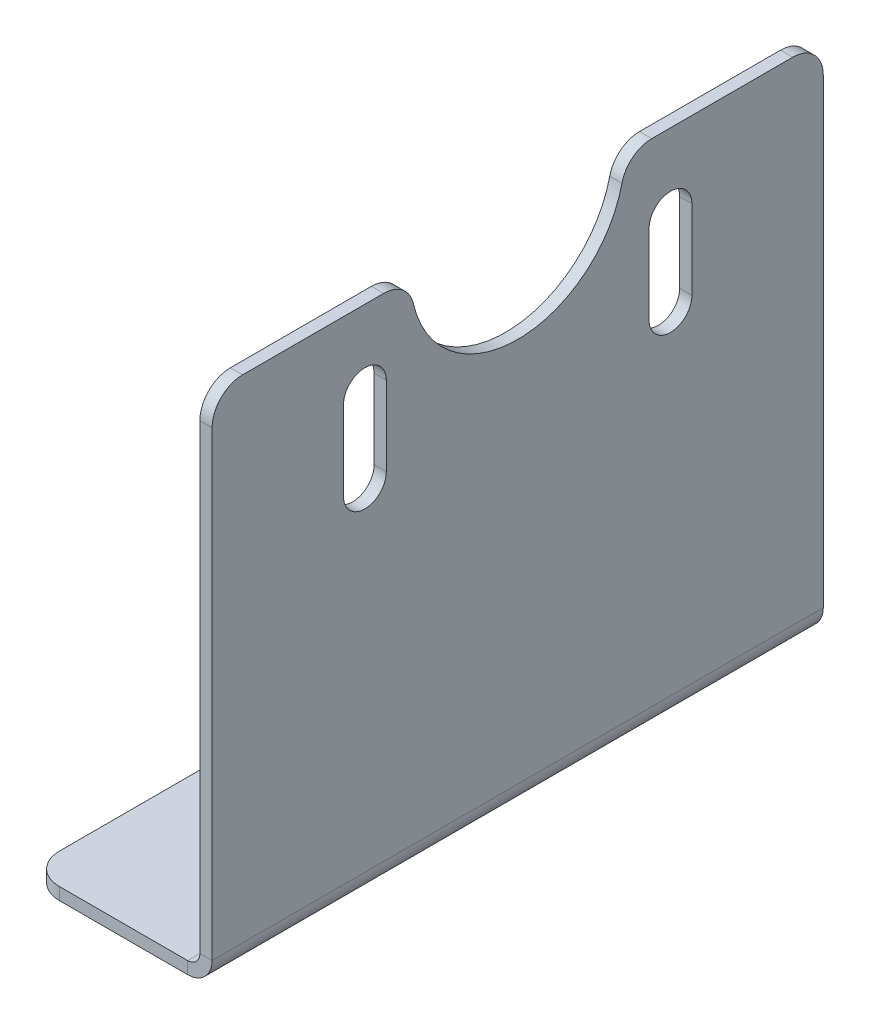
ISO-10303-21;
HEADER;
FILE_DESCRIPTION(('STEP AP214'),'2;1');
FILE_NAME('part.step','',(''),(''),'','','');
FILE_SCHEMA(('AUTOMOTIVE_DESIGN { 1 0 10303 214 1 1 1 1 }'));
ENDSEC;
DATA;
#1=APPLICATION_CONTEXT('core data for automotive mechanical design processes');
#2=APPLICATION_PROTOCOL_DEFINITION('international standard','automotive_design',2000,#1);
#3=PRODUCT_CONTEXT('',#1,'mechanical');
#4=PRODUCT('Part','Part','',(#3));
#5=PRODUCT_RELATED_PRODUCT_CATEGORY('part','',(#4));
#6=PRODUCT_DEFINITION_FORMATION('','',#4);
#7=PRODUCT_DEFINITION_CONTEXT('part definition',#1,'design');
#8=PRODUCT_DEFINITION('design','',#6,#7);
#9=PRODUCT_DEFINITION_SHAPE('','',#8);
#10=(LENGTH_UNIT() NAMED_UNIT(*) SI_UNIT(.MILLI.,.METRE.));
#11=(NAMED_UNIT(*) PLANE_ANGLE_UNIT() SI_UNIT($,.RADIAN.));
#12=(NAMED_UNIT(*) SI_UNIT($,.STERADIAN.) SOLID_ANGLE_UNIT());
#13=UNCERTAINTY_MEASURE_WITH_UNIT(LENGTH_MEASURE(1.E-05),#10,'distance_accuracy_value','');
#14=(GEOMETRIC_REPRESENTATION_CONTEXT(3) GLOBAL_UNCERTAINTY_ASSIGNED_CONTEXT((#13)) GLOBAL_UNIT_ASSIGNED_CONTEXT((#10,
#11,#12)) REPRESENTATION_CONTEXT('',''));
#15=CARTESIAN_POINT('',(0.,0.,0.));
#16=DIRECTION('',(0.,0.,1.));
#17=DIRECTION('',(1.,0.,0.));
#18=AXIS2_PLACEMENT_3D('',#15,#16,#17);
#19=CARTESIAN_POINT('',(-2.00000000000001,84.5,100.));
#20=DIRECTION('',(0.,1.,0.));
#21=DIRECTION('',(0.,0.,1.));
#22=AXIS2_PLACEMENT_3D('',#19,#20,#21);
#23=PLANE('',#22);
#24=DIRECTION('',(0.,0.,-1.));
#25=VECTOR('',#24,1.);
#26=CARTESIAN_POINT('',(0.,84.5,100.));
#27=LINE('',#26,#25);
#28=CARTESIAN_POINT('',(0.,84.5,28.0625890315197));
#29=VERTEX_POINT('',#28);
#30=CARTESIAN_POINT('',(0.,84.5,5.));
#31=VERTEX_POINT('',#30);
#32=EDGE_CURVE('E318',#29,#31,#27,.T.);
#33=ORIENTED_EDGE('',*,*,#32,.T.);
#34=DIRECTION('',(1.,0.,0.));
#35=VECTOR('',#34,1.);
#36=CARTESIAN_POINT('',(-2.00000000000001,84.5,5.));
#37=LINE('',#36,#35);
#38=CARTESIAN_POINT('',(-2.00000000000001,84.5,5.));
#39=VERTEX_POINT('',#38);
#40=EDGE_CURVE('E360',#31,#39,#37,.F.);
#41=ORIENTED_EDGE('',*,*,#40,.T.);
#42=DIRECTION('',(0.,0.,-1.));
#43=VECTOR('',#42,1.);
#44=CARTESIAN_POINT('',(-2.00000000000001,84.5,100.));
#45=LINE('',#44,#43);
#46=CARTESIAN_POINT('',(-2.00000000000001,84.5,28.0625890315197));
#47=VERTEX_POINT('',#46);
#48=EDGE_CURVE('E314',#47,#39,#45,.T.);
#49=ORIENTED_EDGE('',*,*,#48,.F.);
#50=DIRECTION('',(1.,0.,0.));
#51=VECTOR('',#50,1.);
#52=CARTESIAN_POINT('',(0.,84.5,28.0625890315197));
#53=LINE('',#52,#51);
#54=EDGE_CURVE('E358',#47,#29,#53,.T.);
#55=ORIENTED_EDGE('',*,*,#54,.T.);
#56=EDGE_LOOP('',(#33,#41,#49,#55));
#57=FACE_BOUND('',#56,.T.);
#58=ADVANCED_FACE('F39',(#57),#23,.T.);
#59=CARTESIAN_POINT('',(-4.,0.,100.));
#60=DIRECTION('',(0.,0.,1.));
#61=DIRECTION('',(1.,0.,0.));
#62=AXIS2_PLACEMENT_3D('',#59,#60,#61);
#63=PLANE('',#62);
#64=DIRECTION('',(0.,1.,0.));
#65=VECTOR('',#64,1.);
#66=CARTESIAN_POINT('',(-4.,0.,100.));
#67=LINE('',#66,#65);
#68=CARTESIAN_POINT('',(-4.,0.,100.));
#69=VERTEX_POINT('',#68);
#70=CARTESIAN_POINT('',(-4.,2.,100.));
#71=VERTEX_POINT('',#70);
#72=EDGE_CURVE('E342',#69,#71,#67,.T.);
#73=ORIENTED_EDGE('',*,*,#72,.F.);
#74=CARTESIAN_POINT('',(-4.,4.,100.));
#75=DIRECTION('',(0.,0.,1.));
#76=DIRECTION('',(1.,0.,0.));
#77=AXIS2_PLACEMENT_3D('',#74,#75,#76);
#78=CIRCLE('',#77,4.);
#79=CARTESIAN_POINT('',(0.,4.,100.));
#80=VERTEX_POINT('',#79);
#81=EDGE_CURVE('E284',#80,#69,#78,.F.);
#82=ORIENTED_EDGE('',*,*,#81,.F.);
#83=DIRECTION('',(1.,0.,0.));
#84=VECTOR('',#83,1.);
#85=CARTESIAN_POINT('',(-2.,4.,100.));
#86=LINE('',#85,#84);
#87=CARTESIAN_POINT('',(-2.,4.,100.));
#88=VERTEX_POINT('',#87);
#89=EDGE_CURVE('E339',#88,#80,#86,.T.);
#90=ORIENTED_EDGE('',*,*,#89,.F.);
#91=CARTESIAN_POINT('',(-4.,4.,100.));
#92=DIRECTION('',(0.,0.,1.));
#93=DIRECTION('',(1.,0.,0.));
#94=AXIS2_PLACEMENT_3D('',#91,#92,#93);
#95=CIRCLE('',#94,2.);
#96=EDGE_CURVE('E291',#88,#71,#95,.F.);
#97=ORIENTED_EDGE('',*,*,#96,.T.);
#98=EDGE_LOOP('',(#73,#82,#90,#97));
#99=FACE_BOUND('',#98,.T.);
#100=ADVANCED_FACE('F444',(#99),#63,.T.);
#101=CARTESIAN_POINT('',(-2.,4.,100.));
#102=DIRECTION('',(0.,0.,1.));
#103=DIRECTION('',(1.,0.,0.));
#104=AXIS2_PLACEMENT_3D('',#101,#102,#103);
#105=PLANE('',#104);
#106=DIRECTION('',(-1.,0.,0.));
#107=VECTOR('',#106,1.);
#108=CARTESIAN_POINT('',(0.,2.,100.));
#109=LINE('',#108,#107);
#110=CARTESIAN_POINT('',(-25.,2.,100.));
#111=VERTEX_POINT('',#110);
#112=EDGE_CURVE('E277',#71,#111,#109,.T.);
#113=ORIENTED_EDGE('',*,*,#112,.T.);
#114=DIRECTION('',(0.,1.,0.));
#115=VECTOR('',#114,1.);
#116=CARTESIAN_POINT('',(-25.,4.,100.));
#117=LINE('',#116,#115);
#118=CARTESIAN_POINT('',(-25.,0.,100.));
#119=VERTEX_POINT('',#118);
#120=EDGE_CURVE('E392',#111,#119,#117,.F.);
#121=ORIENTED_EDGE('',*,*,#120,.T.);
#122=DIRECTION('',(-1.,0.,0.));
#123=VECTOR('',#122,1.);
#124=CARTESIAN_POINT('',(0.,0.,100.));
#125=LINE('',#124,#123);
#126=EDGE_CURVE('E280',#69,#119,#125,.T.);
#127=ORIENTED_EDGE('',*,*,#126,.F.);
#128=ORIENTED_EDGE('',*,*,#72,.T.);
#129=EDGE_LOOP('',(#113,#121,#127,#128));
#130=FACE_BOUND('',#129,.T.);
#131=ADVANCED_FACE('F448',(#130),#105,.T.);
#132=CARTESIAN_POINT('',(0.,4.,0.));
#133=DIRECTION('',(0.,0.,-1.));
#134=DIRECTION('',(-1.,0.,0.));
#135=AXIS2_PLACEMENT_3D('',#132,#133,#134);
#136=PLANE('',#135);
#137=DIRECTION('',(-1.,0.,0.));
#138=VECTOR('',#137,1.);
#139=CARTESIAN_POINT('',(0.,4.,0.));
#140=LINE('',#139,#138);
#141=CARTESIAN_POINT('',(0.,4.,0.));
#142=VERTEX_POINT('',#141);
#143=CARTESIAN_POINT('',(-2.,4.,0.));
#144=VERTEX_POINT('',#143);
#145=EDGE_CURVE('E336',#142,#144,#140,.T.);
#146=ORIENTED_EDGE('',*,*,#145,.F.);
#147=CARTESIAN_POINT('',(-4.,4.,0.));
#148=DIRECTION('',(0.,0.,1.));
#149=DIRECTION('',(1.,0.,0.));
#150=AXIS2_PLACEMENT_3D('',#147,#148,#149);
#151=CIRCLE('',#150,4.);
#152=CARTESIAN_POINT('',(-4.,0.,0.));
#153=VERTEX_POINT('',#152);
#154=EDGE_CURVE('E300',#142,#153,#151,.F.);
#155=ORIENTED_EDGE('',*,*,#154,.T.);
#156=DIRECTION('',(0.,-1.,0.));
#157=VECTOR('',#156,1.);
#158=CARTESIAN_POINT('',(-4.,2.,0.));
#159=LINE('',#158,#157);
#160=CARTESIAN_POINT('',(-4.,2.,0.));
#161=VERTEX_POINT('',#160);
#162=EDGE_CURVE('E334',#161,#153,#159,.T.);
#163=ORIENTED_EDGE('',*,*,#162,.F.);
#164=CARTESIAN_POINT('',(-4.,4.,0.));
#165=DIRECTION('',(0.,0.,1.));
#166=DIRECTION('',(1.,0.,0.));
#167=AXIS2_PLACEMENT_3D('',#164,#165,#166);
#168=CIRCLE('',#167,2.);
#169=EDGE_CURVE('E281',#144,#161,#168,.F.);
#170=ORIENTED_EDGE('',*,*,#169,.F.);
#171=EDGE_LOOP('',(#146,#155,#163,#170));
#172=FACE_BOUND('',#171,.T.);
#173=ADVANCED_FACE('F437',(#172),#136,.T.);
#174=CARTESIAN_POINT('',(-4.,2.,0.));
#175=DIRECTION('',(0.,0.,-1.));
#176=DIRECTION('',(-1.,0.,0.));
#177=AXIS2_PLACEMENT_3D('',#174,#175,#176);
#178=PLANE('',#177);
#179=DIRECTION('',(0.,-1.,0.));
#180=VECTOR('',#179,1.);
#181=CARTESIAN_POINT('',(-2.00000000000001,84.5,0.));
#182=LINE('',#181,#180);
#183=CARTESIAN_POINT('',(-2.00000000000001,79.5,0.));
#184=VERTEX_POINT('',#183);
#185=EDGE_CURVE('E305',#184,#144,#182,.T.);
#186=ORIENTED_EDGE('',*,*,#185,.F.);
#187=DIRECTION('',(1.,0.,0.));
#188=VECTOR('',#187,1.);
#189=CARTESIAN_POINT('',(-4.,79.5,0.));
#190=LINE('',#189,#188);
#191=CARTESIAN_POINT('',(0.,79.5,0.));
#192=VERTEX_POINT('',#191);
#193=EDGE_CURVE('E347',#184,#192,#190,.T.);
#194=ORIENTED_EDGE('',*,*,#193,.T.);
#195=DIRECTION('',(0.,-1.,0.));
#196=VECTOR('',#195,1.);
#197=CARTESIAN_POINT('',(0.,84.5,0.));
#198=LINE('',#197,#196);
#199=EDGE_CURVE('E303',#192,#142,#198,.T.);
#200=ORIENTED_EDGE('',*,*,#199,.T.);
#201=ORIENTED_EDGE('',*,*,#145,.T.);
#202=EDGE_LOOP('',(#186,#194,#200,#201));
#203=FACE_BOUND('',#202,.T.);
#204=ADVANCED_FACE('F459',(#203),#178,.T.);
#205=CARTESIAN_POINT('',(0.,2.,100.));
#206=DIRECTION('',(0.,-1.,0.));
#207=DIRECTION('',(1.,0.,0.));
#208=AXIS2_PLACEMENT_3D('',#205,#206,#207);
#209=PLANE('',#208);
#210=CARTESIAN_POINT('',(-15.,2.,25.));
#211=DIRECTION('',(0.,1.,0.));
#212=DIRECTION('',(0.,0.,1.));
#213=AXIS2_PLACEMENT_3D('',#210,#211,#212);
#214=CIRCLE('',#213,3.);
#215=CARTESIAN_POINT('',(-15.,2.,28.));
#216=VERTEX_POINT('',#215);
#217=EDGE_CURVE('E267',#216,#216,#214,.T.);
#218=ORIENTED_EDGE('',*,*,#217,.F.);
#219=EDGE_LOOP('',(#218));
#220=FACE_BOUND('',#219,.T.);
#221=CARTESIAN_POINT('',(-15.,2.,75.));
#222=DIRECTION('',(0.,1.,0.));
#223=DIRECTION('',(0.,0.,1.));
#224=AXIS2_PLACEMENT_3D('',#221,#222,#223);
#225=CIRCLE('',#224,3.);
#226=CARTESIAN_POINT('',(-15.,2.,78.));
#227=VERTEX_POINT('',#226);
#228=EDGE_CURVE('E266',#227,#227,#225,.T.);
#229=ORIENTED_EDGE('',*,*,#228,.F.);
#230=EDGE_LOOP('',(#229));
#231=FACE_BOUND('',#230,.T.);
#232=DIRECTION('',(0.,0.,-1.));
#233=VECTOR('',#232,1.);
#234=CARTESIAN_POINT('',(-30.,2.,100.));
#235=LINE('',#234,#233);
#236=CARTESIAN_POINT('',(-30.,2.,95.));
#237=VERTEX_POINT('',#236);
#238=CARTESIAN_POINT('',(-30.,2.,5.));
#239=VERTEX_POINT('',#238);
#240=EDGE_CURVE('E331',#237,#239,#235,.T.);
#241=ORIENTED_EDGE('',*,*,#240,.F.);
#242=CARTESIAN_POINT('',(-25.,2.,95.));
#243=DIRECTION('',(0.,-1.,0.));
#244=DIRECTION('',(1.,0.,0.));
#245=AXIS2_PLACEMENT_3D('',#242,#243,#244);
#246=CIRCLE('',#245,5.);
#247=EDGE_CURVE('E390',#237,#111,#246,.F.);
#248=ORIENTED_EDGE('',*,*,#247,.T.);
#249=ORIENTED_EDGE('',*,*,#112,.F.);
#250=DIRECTION('',(0.,0.,-1.));
#251=VECTOR('',#250,1.);
#252=CARTESIAN_POINT('',(-4.,2.,100.));
#253=LINE('',#252,#251);
#254=EDGE_CURVE('E294',#71,#161,#253,.T.);
#255=ORIENTED_EDGE('',*,*,#254,.T.);
#256=DIRECTION('',(-1.,0.,0.));
#257=VECTOR('',#256,1.);
#258=CARTESIAN_POINT('',(0.,2.,0.));
#259=LINE('',#258,#257);
#260=CARTESIAN_POINT('',(-25.,2.,0.));
#261=VERTEX_POINT('',#260);
#262=EDGE_CURVE('E276',#161,#261,#259,.T.);
#263=ORIENTED_EDGE('',*,*,#262,.T.);
#264=CARTESIAN_POINT('',(-25.,2.,5.));
#265=DIRECTION('',(0.,-1.,0.));
#266=DIRECTION('',(1.,0.,0.));
#267=AXIS2_PLACEMENT_3D('',#264,#265,#266);
#268=CIRCLE('',#267,5.);
#269=EDGE_CURVE('E388',#261,#239,#268,.F.);
#270=ORIENTED_EDGE('',*,*,#269,.T.);
#271=EDGE_LOOP('',(#241,#248,#249,#255,#263,#270));
#272=FACE_BOUND('',#271,.T.);
#273=ADVANCED_FACE('F426',(#220,#231,#272),#209,.F.);
#274=CARTESIAN_POINT('',(-30.,0.,100.));
#275=DIRECTION('',(-1.,0.,0.));
#276=DIRECTION('',(0.,0.,1.));
#277=AXIS2_PLACEMENT_3D('',#274,#275,#276);
#278=PLANE('',#277);
#279=DIRECTION('',(0.,0.,-1.));
#280=VECTOR('',#279,1.);
#281=CARTESIAN_POINT('',(-30.,0.,100.));
#282=LINE('',#281,#280);
#283=CARTESIAN_POINT('',(-30.,0.,95.));
#284=VERTEX_POINT('',#283);
#285=CARTESIAN_POINT('',(-30.,0.,5.));
#286=VERTEX_POINT('',#285);
#287=EDGE_CURVE('E328',#284,#286,#282,.T.);
#288=ORIENTED_EDGE('',*,*,#287,.F.);
#289=DIRECTION('',(0.,1.,0.));
#290=VECTOR('',#289,1.);
#291=CARTESIAN_POINT('',(-30.,0.,95.));
#292=LINE('',#291,#290);
#293=EDGE_CURVE('E385',#284,#237,#292,.T.);
#294=ORIENTED_EDGE('',*,*,#293,.T.);
#295=ORIENTED_EDGE('',*,*,#240,.T.);
#296=DIRECTION('',(0.,1.,0.));
#297=VECTOR('',#296,1.);
#298=CARTESIAN_POINT('',(-30.,0.,5.));
#299=LINE('',#298,#297);
#300=EDGE_CURVE('E383',#239,#286,#299,.F.);
#301=ORIENTED_EDGE('',*,*,#300,.T.);
#302=EDGE_LOOP('',(#288,#294,#295,#301));
#303=FACE_BOUND('',#302,.T.);
#304=ADVANCED_FACE('F409',(#303),#278,.T.);
#305=CARTESIAN_POINT('',(0.,0.,100.));
#306=DIRECTION('',(0.,-1.,0.));
#307=DIRECTION('',(1.,0.,0.));
#308=AXIS2_PLACEMENT_3D('',#305,#306,#307);
#309=PLANE('',#308);
#310=CARTESIAN_POINT('',(-15.,0.,25.));
#311=DIRECTION('',(0.,-1.,0.));
#312=DIRECTION('',(1.,0.,0.));
#313=AXIS2_PLACEMENT_3D('',#310,#311,#312);
#314=CIRCLE('',#313,3.);
#315=CARTESIAN_POINT('',(-12.,0.,25.));
#316=VERTEX_POINT('',#315);
#317=EDGE_CURVE('E43',#316,#316,#314,.T.);
#318=ORIENTED_EDGE('',*,*,#317,.F.);
#319=EDGE_LOOP('',(#318));
#320=FACE_BOUND('',#319,.T.);
#321=CARTESIAN_POINT('',(-15.,0.,75.));
#322=DIRECTION('',(0.,-1.,0.));
#323=DIRECTION('',(1.,0.,0.));
#324=AXIS2_PLACEMENT_3D('',#321,#322,#323);
#325=CIRCLE('',#324,3.);
#326=CARTESIAN_POINT('',(-12.,0.,75.));
#327=VERTEX_POINT('',#326);
#328=EDGE_CURVE('E270',#327,#327,#325,.T.);
#329=ORIENTED_EDGE('',*,*,#328,.F.);
#330=EDGE_LOOP('',(#329));
#331=FACE_BOUND('',#330,.T.);
#332=ORIENTED_EDGE('',*,*,#126,.T.);
#333=CARTESIAN_POINT('',(-25.,0.,95.));
#334=DIRECTION('',(0.,-1.,0.));
#335=DIRECTION('',(1.,0.,0.));
#336=AXIS2_PLACEMENT_3D('',#333,#334,#335);
#337=CIRCLE('',#336,5.);
#338=EDGE_CURVE('E48',#119,#284,#337,.T.);
#339=ORIENTED_EDGE('',*,*,#338,.T.);
#340=ORIENTED_EDGE('',*,*,#287,.T.);
#341=CARTESIAN_POINT('',(-25.,0.,5.));
#342=DIRECTION('',(0.,-1.,0.));
#343=DIRECTION('',(1.,0.,0.));
#344=AXIS2_PLACEMENT_3D('',#341,#342,#343);
#345=CIRCLE('',#344,5.);
#346=CARTESIAN_POINT('',(-25.,0.,0.));
#347=VERTEX_POINT('',#346);
#348=EDGE_CURVE('E394',#286,#347,#345,.T.);
#349=ORIENTED_EDGE('',*,*,#348,.T.);
#350=DIRECTION('',(-1.,0.,0.));
#351=VECTOR('',#350,1.);
#352=CARTESIAN_POINT('',(0.,0.,0.));
#353=LINE('',#352,#351);
#354=EDGE_CURVE('E297',#153,#347,#353,.T.);
#355=ORIENTED_EDGE('',*,*,#354,.F.);
#356=DIRECTION('',(0.,0.,-1.));
#357=VECTOR('',#356,1.);
#358=CARTESIAN_POINT('',(-4.,0.,100.));
#359=LINE('',#358,#357);
#360=EDGE_CURVE('E325',#69,#153,#359,.T.);
#361=ORIENTED_EDGE('',*,*,#360,.F.);
#362=EDGE_LOOP('',(#332,#339,#340,#349,#355,#361));
#363=FACE_BOUND('',#362,.T.);
#364=ADVANCED_FACE('F405',(#320,#331,#363),#309,.T.);
#365=CARTESIAN_POINT('',(-4.,4.,100.));
#366=DIRECTION('',(0.,0.,-1.));
#367=DIRECTION('',(-1.,0.,0.));
#368=AXIS2_PLACEMENT_3D('',#365,#366,#367);
#369=CYLINDRICAL_SURFACE('',#368,4.);
#370=ORIENTED_EDGE('',*,*,#154,.F.);
#371=DIRECTION('',(0.,0.,-1.));
#372=VECTOR('',#371,1.);
#373=CARTESIAN_POINT('',(0.,4.,100.));
#374=LINE('',#373,#372);
#375=EDGE_CURVE('E322',#80,#142,#374,.T.);
#376=ORIENTED_EDGE('',*,*,#375,.F.);
#377=ORIENTED_EDGE('',*,*,#81,.T.);
#378=ORIENTED_EDGE('',*,*,#360,.T.);
#379=EDGE_LOOP('',(#370,#376,#377,#378));
#380=FACE_BOUND('',#379,.T.);
#381=ADVANCED_FACE('F408',(#380),#369,.T.);
#382=CARTESIAN_POINT('',(0.,84.5,100.));
#383=DIRECTION('',(1.,0.,0.));
#384=DIRECTION('',(0.,1.,0.));
#385=AXIS2_PLACEMENT_3D('',#382,#383,#384);
#386=PLANE('',#385);
#387=CARTESIAN_POINT('',(0.,72.,25.));
#388=DIRECTION('',(1.,0.,0.));
#389=DIRECTION('',(0.,1.,0.));
#390=AXIS2_PLACEMENT_3D('',#387,#388,#389);
#391=CIRCLE('',#390,3.5);
#392=CARTESIAN_POINT('',(0.,72.,21.5));
#393=VERTEX_POINT('',#392);
#394=CARTESIAN_POINT('',(0.,72.,28.5));
#395=VERTEX_POINT('',#394);
#396=EDGE_CURVE('E264',#393,#395,#391,.T.);
#397=ORIENTED_EDGE('',*,*,#396,.F.);
#398=DIRECTION('',(0.,1.,0.));
#399=VECTOR('',#398,1.);
#400=CARTESIAN_POINT('',(0.,84.5,21.5));
#401=LINE('',#400,#399);
#402=CARTESIAN_POINT('',(0.,59.,21.5));
#403=VERTEX_POINT('',#402);
#404=EDGE_CURVE('E259',#403,#393,#401,.T.);
#405=ORIENTED_EDGE('',*,*,#404,.F.);
#406=CARTESIAN_POINT('',(0.,59.,25.));
#407=DIRECTION('',(1.,0.,0.));
#408=DIRECTION('',(0.,1.,0.));
#409=AXIS2_PLACEMENT_3D('',#406,#407,#408);
#410=CIRCLE('',#409,3.5);
#411=CARTESIAN_POINT('',(0.,59.,28.5));
#412=VERTEX_POINT('',#411);
#413=EDGE_CURVE('E207',#412,#403,#410,.T.);
#414=ORIENTED_EDGE('',*,*,#413,.F.);
#415=DIRECTION('',(0.,-1.,0.));
#416=VECTOR('',#415,1.);
#417=CARTESIAN_POINT('',(0.,84.5,28.5));
#418=LINE('',#417,#416);
#419=EDGE_CURVE('E262',#395,#412,#418,.T.);
#420=ORIENTED_EDGE('',*,*,#419,.F.);
#421=EDGE_LOOP('',(#397,#405,#414,#420));
#422=FACE_BOUND('',#421,.T.);
#423=CARTESIAN_POINT('',(0.,59.,75.));
#424=DIRECTION('',(1.,0.,0.));
#425=DIRECTION('',(0.,1.,0.));
#426=AXIS2_PLACEMENT_3D('',#423,#424,#425);
#427=CIRCLE('',#426,3.5);
#428=CARTESIAN_POINT('',(0.,59.0000000000001,78.5));
#429=VERTEX_POINT('',#428);
#430=CARTESIAN_POINT('',(0.,59.,71.5));
#431=VERTEX_POINT('',#430);
#432=EDGE_CURVE('E257',#429,#431,#427,.T.);
#433=ORIENTED_EDGE('',*,*,#432,.F.);
#434=DIRECTION('',(0.,-1.,0.));
#435=VECTOR('',#434,1.);
#436=CARTESIAN_POINT('',(0.,84.4999999999999,78.4999999999999));
#437=LINE('',#436,#435);
#438=CARTESIAN_POINT('',(0.,72.0000000000001,78.4999999999999));
#439=VERTEX_POINT('',#438);
#440=EDGE_CURVE('E231',#439,#429,#437,.T.);
#441=ORIENTED_EDGE('',*,*,#440,.F.);
#442=CARTESIAN_POINT('',(0.,72.,75.));
#443=DIRECTION('',(1.,0.,0.));
#444=DIRECTION('',(0.,1.,0.));
#445=AXIS2_PLACEMENT_3D('',#442,#443,#444);
#446=CIRCLE('',#445,3.5);
#447=CARTESIAN_POINT('',(0.,72.0000000000001,71.5));
#448=VERTEX_POINT('',#447);
#449=EDGE_CURVE('E253',#448,#439,#446,.T.);
#450=ORIENTED_EDGE('',*,*,#449,.F.);
#451=DIRECTION('',(0.,1.,0.));
#452=VECTOR('',#451,1.);
#453=CARTESIAN_POINT('',(0.,84.4999999999999,71.4999999999999));
#454=LINE('',#453,#452);
#455=EDGE_CURVE('E255',#431,#448,#454,.T.);
#456=ORIENTED_EDGE('',*,*,#455,.F.);
#457=EDGE_LOOP('',(#433,#441,#450,#456));
#458=FACE_BOUND('',#457,.T.);
#459=ORIENTED_EDGE('',*,*,#199,.F.);
#460=CARTESIAN_POINT('',(0.,79.5,5.));
#461=DIRECTION('',(1.,0.,0.));
#462=DIRECTION('',(0.,1.,0.));
#463=AXIS2_PLACEMENT_3D('',#460,#461,#462);
#464=CIRCLE('',#463,5.);
#465=EDGE_CURVE('E356',#192,#31,#464,.T.);
#466=ORIENTED_EDGE('',*,*,#465,.T.);
#467=ORIENTED_EDGE('',*,*,#32,.F.);
#468=CARTESIAN_POINT('',(0.,79.5,28.0625890315197));
#469=DIRECTION('',(1.,0.,0.));
#470=DIRECTION('',(0.,1.,0.));
#471=AXIS2_PLACEMENT_3D('',#468,#469,#470);
#472=CIRCLE('',#471,5.);
#473=CARTESIAN_POINT('',(0.,80.6111111111111,32.9375692467375));
#474=VERTEX_POINT('',#473);
#475=EDGE_CURVE('E350',#29,#474,#472,.T.);
#476=ORIENTED_EDGE('',*,*,#475,.T.);
#477=CARTESIAN_POINT('',(0.,84.5,50.));
#478=DIRECTION('',(1.,0.,0.));
#479=DIRECTION('',(0.,1.,0.));
#480=AXIS2_PLACEMENT_3D('',#477,#478,#479);
#481=CIRCLE('',#480,17.5);
#482=CARTESIAN_POINT('',(0.,80.6111111111111,67.0624307532625));
#483=VERTEX_POINT('',#482);
#484=EDGE_CURVE('E273',#483,#474,#481,.T.);
#485=ORIENTED_EDGE('',*,*,#484,.F.);
#486=CARTESIAN_POINT('',(0.,79.5,71.9374109684803));
#487=DIRECTION('',(1.,0.,0.));
#488=DIRECTION('',(0.,1.,0.));
#489=AXIS2_PLACEMENT_3D('',#486,#487,#488);
#490=CIRCLE('',#489,5.);
#491=CARTESIAN_POINT('',(0.,84.5,71.9374109684803));
#492=VERTEX_POINT('',#491);
#493=EDGE_CURVE('E352',#483,#492,#490,.T.);
#494=ORIENTED_EDGE('',*,*,#493,.T.);
#495=CARTESIAN_POINT('',(0.,84.5,95.));
#496=VERTEX_POINT('',#495);
#497=EDGE_CURVE('E321',#496,#492,#27,.T.);
#498=ORIENTED_EDGE('',*,*,#497,.F.);
#499=CARTESIAN_POINT('',(0.,79.5,95.));
#500=DIRECTION('',(1.,0.,0.));
#501=DIRECTION('',(0.,1.,0.));
#502=AXIS2_PLACEMENT_3D('',#499,#500,#501);
#503=CIRCLE('',#502,5.);
#504=CARTESIAN_POINT('',(0.,79.5,100.));
#505=VERTEX_POINT('',#504);
#506=EDGE_CURVE('E354',#496,#505,#503,.T.);
#507=ORIENTED_EDGE('',*,*,#506,.T.);
#508=DIRECTION('',(0.,-1.,0.));
#509=VECTOR('',#508,1.);
#510=CARTESIAN_POINT('',(0.,84.5,100.));
#511=LINE('',#510,#509);
#512=EDGE_CURVE('E287',#505,#80,#511,.T.);
#513=ORIENTED_EDGE('',*,*,#512,.T.);
#514=ORIENTED_EDGE('',*,*,#375,.T.);
#515=EDGE_LOOP('',(#459,#466,#467,#476,#485,#494,#498,#507,#513,#514));
#516=FACE_BOUND('',#515,.T.);
#517=ADVANCED_FACE('F462',(#422,#458,#516),#386,.T.);
#518=CARTESIAN_POINT('',(-2.00000000000001,84.5,95.));
#519=VERTEX_POINT('',#518);
#520=CARTESIAN_POINT('',(-2.00000000000001,84.5,71.9374109684803));
#521=VERTEX_POINT('',#520);
#522=EDGE_CURVE('E315',#519,#521,#45,.T.);
#523=ORIENTED_EDGE('',*,*,#522,.F.);
#524=DIRECTION('',(1.,0.,0.));
#525=VECTOR('',#524,1.);
#526=CARTESIAN_POINT('',(-2.00000000000001,84.5,95.));
#527=LINE('',#526,#525);
#528=EDGE_CURVE('E372',#519,#496,#527,.T.);
#529=ORIENTED_EDGE('',*,*,#528,.T.);
#530=ORIENTED_EDGE('',*,*,#497,.T.);
#531=DIRECTION('',(1.,0.,0.));
#532=VECTOR('',#531,1.);
#533=CARTESIAN_POINT('',(-2.00000000000001,84.5,71.9374109684803));
#534=LINE('',#533,#532);
#535=EDGE_CURVE('E370',#492,#521,#534,.F.);
#536=ORIENTED_EDGE('',*,*,#535,.T.);
#537=EDGE_LOOP('',(#523,#529,#530,#536));
#538=FACE_BOUND('',#537,.T.);
#539=ADVANCED_FACE('F475',(#538),#23,.T.);
#540=CARTESIAN_POINT('',(-2.00000000000001,84.5,100.));
#541=DIRECTION('',(1.,0.,0.));
#542=DIRECTION('',(0.,1.,0.));
#543=AXIS2_PLACEMENT_3D('',#540,#541,#542);
#544=PLANE('',#543);
#545=DIRECTION('',(0.,-1.,0.));
#546=VECTOR('',#545,1.);
#547=CARTESIAN_POINT('',(-2.,72.,21.5));
#548=LINE('',#547,#546);
#549=CARTESIAN_POINT('',(-2.,72.,21.5));
#550=VERTEX_POINT('',#549);
#551=CARTESIAN_POINT('',(-2.,59.,21.5));
#552=VERTEX_POINT('',#551);
#553=EDGE_CURVE('E214',#550,#552,#548,.T.);
#554=ORIENTED_EDGE('',*,*,#553,.F.);
#555=CARTESIAN_POINT('',(-2.,72.,25.));
#556=DIRECTION('',(-1.,0.,0.));
#557=DIRECTION('',(0.,-1.,0.));
#558=AXIS2_PLACEMENT_3D('',#555,#556,#557);
#559=CIRCLE('',#558,3.5);
#560=CARTESIAN_POINT('',(-2.,72.,28.5));
#561=VERTEX_POINT('',#560);
#562=EDGE_CURVE('E219',#561,#550,#559,.T.);
#563=ORIENTED_EDGE('',*,*,#562,.F.);
#564=DIRECTION('',(0.,1.,0.));
#565=VECTOR('',#564,1.);
#566=CARTESIAN_POINT('',(-2.,59.,28.5));
#567=LINE('',#566,#565);
#568=CARTESIAN_POINT('',(-2.,59.,28.5));
#569=VERTEX_POINT('',#568);
#570=EDGE_CURVE('E224',#569,#561,#567,.T.);
#571=ORIENTED_EDGE('',*,*,#570,.F.);
#572=CARTESIAN_POINT('',(-2.,59.,25.));
#573=DIRECTION('',(-1.,0.,0.));
#574=DIRECTION('',(0.,1.,0.));
#575=AXIS2_PLACEMENT_3D('',#572,#573,#574);
#576=CIRCLE('',#575,3.5);
#577=EDGE_CURVE('E204',#552,#569,#576,.T.);
#578=ORIENTED_EDGE('',*,*,#577,.F.);
#579=EDGE_LOOP('',(#554,#563,#571,#578));
#580=FACE_BOUND('',#579,.T.);
#581=DIRECTION('',(0.,1.,0.));
#582=VECTOR('',#581,1.);
#583=CARTESIAN_POINT('',(-2.,72.0000000000001,78.4999999999999));
#584=LINE('',#583,#582);
#585=CARTESIAN_POINT('',(-2.,59.0000000000001,78.5));
#586=VERTEX_POINT('',#585);
#587=CARTESIAN_POINT('',(-2.,72.0000000000001,78.5));
#588=VERTEX_POINT('',#587);
#589=EDGE_CURVE('E236',#586,#588,#584,.T.);
#590=ORIENTED_EDGE('',*,*,#589,.F.);
#591=CARTESIAN_POINT('',(-2.,59.,75.));
#592=DIRECTION('',(-1.,0.,0.));
#593=DIRECTION('',(0.,-1.,0.));
#594=AXIS2_PLACEMENT_3D('',#591,#592,#593);
#595=CIRCLE('',#594,3.5);
#596=CARTESIAN_POINT('',(-2.,59.,71.5));
#597=VERTEX_POINT('',#596);
#598=EDGE_CURVE('E234',#597,#586,#595,.T.);
#599=ORIENTED_EDGE('',*,*,#598,.F.);
#600=DIRECTION('',(0.,-1.,0.));
#601=VECTOR('',#600,1.);
#602=CARTESIAN_POINT('',(-2.,59.,71.5));
#603=LINE('',#602,#601);
#604=CARTESIAN_POINT('',(-2.,72.0000000000001,71.5));
#605=VERTEX_POINT('',#604);
#606=EDGE_CURVE('E241',#605,#597,#603,.T.);
#607=ORIENTED_EDGE('',*,*,#606,.F.);
#608=CARTESIAN_POINT('',(-2.,72.,75.));
#609=DIRECTION('',(-1.,0.,0.));
#610=DIRECTION('',(0.,-1.,0.));
#611=AXIS2_PLACEMENT_3D('',#608,#609,#610);
#612=CIRCLE('',#611,3.5);
#613=EDGE_CURVE('E238',#588,#605,#612,.T.);
#614=ORIENTED_EDGE('',*,*,#613,.F.);
#615=EDGE_LOOP('',(#590,#599,#607,#614));
#616=FACE_BOUND('',#615,.T.);
#617=ORIENTED_EDGE('',*,*,#48,.T.);
#618=CARTESIAN_POINT('',(-2.00000000000001,79.5,5.));
#619=DIRECTION('',(1.,0.,0.));
#620=DIRECTION('',(0.,1.,0.));
#621=AXIS2_PLACEMENT_3D('',#618,#619,#620);
#622=CIRCLE('',#621,5.);
#623=EDGE_CURVE('E368',#39,#184,#622,.F.);
#624=ORIENTED_EDGE('',*,*,#623,.T.);
#625=ORIENTED_EDGE('',*,*,#185,.T.);
#626=DIRECTION('',(0.,0.,-1.));
#627=VECTOR('',#626,1.);
#628=CARTESIAN_POINT('',(-2.,4.,100.));
#629=LINE('',#628,#627);
#630=EDGE_CURVE('E311',#88,#144,#629,.T.);
#631=ORIENTED_EDGE('',*,*,#630,.F.);
#632=DIRECTION('',(0.,-1.,0.));
#633=VECTOR('',#632,1.);
#634=CARTESIAN_POINT('',(-2.00000000000001,84.5,100.));
#635=LINE('',#634,#633);
#636=CARTESIAN_POINT('',(-2.00000000000001,79.5,100.));
#637=VERTEX_POINT('',#636);
#638=EDGE_CURVE('E289',#637,#88,#635,.T.);
#639=ORIENTED_EDGE('',*,*,#638,.F.);
#640=CARTESIAN_POINT('',(-2.00000000000001,79.5,95.));
#641=DIRECTION('',(1.,0.,0.));
#642=DIRECTION('',(0.,1.,0.));
#643=AXIS2_PLACEMENT_3D('',#640,#641,#642);
#644=CIRCLE('',#643,5.);
#645=EDGE_CURVE('E366',#637,#519,#644,.F.);
#646=ORIENTED_EDGE('',*,*,#645,.T.);
#647=ORIENTED_EDGE('',*,*,#522,.T.);
#648=CARTESIAN_POINT('',(-2.00000000000001,79.5,71.9374109684803));
#649=DIRECTION('',(1.,0.,0.));
#650=DIRECTION('',(0.,1.,0.));
#651=AXIS2_PLACEMENT_3D('',#648,#649,#650);
#652=CIRCLE('',#651,5.);
#653=CARTESIAN_POINT('',(-2.,80.6111111111111,67.0624307532625));
#654=VERTEX_POINT('',#653);
#655=EDGE_CURVE('E364',#521,#654,#652,.F.);
#656=ORIENTED_EDGE('',*,*,#655,.T.);
#657=CARTESIAN_POINT('',(-2.00000000000001,84.5,50.));
#658=DIRECTION('',(1.,0.,0.));
#659=DIRECTION('',(0.,1.,0.));
#660=AXIS2_PLACEMENT_3D('',#657,#658,#659);
#661=CIRCLE('',#660,17.5);
#662=CARTESIAN_POINT('',(-2.,80.6111111111111,32.9375692467375));
#663=VERTEX_POINT('',#662);
#664=EDGE_CURVE('E344',#654,#663,#661,.T.);
#665=ORIENTED_EDGE('',*,*,#664,.T.);
#666=CARTESIAN_POINT('',(-2.00000000000001,79.5,28.0625890315197));
#667=DIRECTION('',(1.,0.,0.));
#668=DIRECTION('',(0.,1.,0.));
#669=AXIS2_PLACEMENT_3D('',#666,#667,#668);
#670=CIRCLE('',#669,5.);
#671=EDGE_CURVE('E362',#663,#47,#670,.F.);
#672=ORIENTED_EDGE('',*,*,#671,.T.);
#673=EDGE_LOOP('',(#617,#624,#625,#631,#639,#646,#647,#656,#665,#672));
#674=FACE_BOUND('',#673,.T.);
#675=ADVANCED_FACE('F221',(#580,#616,#674),#544,.F.);
#676=CARTESIAN_POINT('',(-4.,4.,100.));
#677=DIRECTION('',(0.,0.,-1.));
#678=DIRECTION('',(-1.,0.,0.));
#679=AXIS2_PLACEMENT_3D('',#676,#677,#678);
#680=CYLINDRICAL_SURFACE('',#679,2.);
#681=ORIENTED_EDGE('',*,*,#169,.T.);
#682=ORIENTED_EDGE('',*,*,#254,.F.);
#683=ORIENTED_EDGE('',*,*,#96,.F.);
#684=ORIENTED_EDGE('',*,*,#630,.T.);
#685=EDGE_LOOP('',(#681,#682,#683,#684));
#686=FACE_BOUND('',#685,.T.);
#687=ADVANCED_FACE('F450',(#686),#680,.F.);
#688=CARTESIAN_POINT('',(-4.,4.,100.));
#689=DIRECTION('',(0.,0.,1.));
#690=DIRECTION('',(1.,0.,0.));
#691=AXIS2_PLACEMENT_3D('',#688,#689,#690);
#692=PLANE('',#691);
#693=ORIENTED_EDGE('',*,*,#512,.F.);
#694=DIRECTION('',(1.,0.,0.));
#695=VECTOR('',#694,1.);
#696=CARTESIAN_POINT('',(-4.,79.5,100.));
#697=LINE('',#696,#695);
#698=EDGE_CURVE('E375',#505,#637,#697,.F.);
#699=ORIENTED_EDGE('',*,*,#698,.T.);
#700=ORIENTED_EDGE('',*,*,#638,.T.);
#701=ORIENTED_EDGE('',*,*,#89,.T.);
#702=EDGE_LOOP('',(#693,#699,#700,#701));
#703=FACE_BOUND('',#702,.T.);
#704=ADVANCED_FACE('F468',(#703),#692,.T.);
#705=CARTESIAN_POINT('',(-4.,4.,0.));
#706=DIRECTION('',(0.,0.,1.));
#707=DIRECTION('',(1.,0.,0.));
#708=AXIS2_PLACEMENT_3D('',#705,#706,#707);
#709=PLANE('',#708);
#710=ORIENTED_EDGE('',*,*,#354,.T.);
#711=DIRECTION('',(0.,1.,0.));
#712=VECTOR('',#711,1.);
#713=CARTESIAN_POINT('',(-25.,2.,0.));
#714=LINE('',#713,#712);
#715=EDGE_CURVE('E11',#347,#261,#714,.T.);
#716=ORIENTED_EDGE('',*,*,#715,.T.);
#717=ORIENTED_EDGE('',*,*,#262,.F.);
#718=ORIENTED_EDGE('',*,*,#162,.T.);
#719=EDGE_LOOP('',(#710,#716,#717,#718));
#720=FACE_BOUND('',#719,.T.);
#721=ADVANCED_FACE('F433',(#720),#709,.F.);
#722=CARTESIAN_POINT('',(7.99999999999999,84.5,50.));
#723=DIRECTION('',(-1.,0.,0.));
#724=DIRECTION('',(0.,-1.,0.));
#725=AXIS2_PLACEMENT_3D('',#722,#723,#724);
#726=CYLINDRICAL_SURFACE('',#725,17.5);
#727=ORIENTED_EDGE('',*,*,#664,.F.);
#728=DIRECTION('',(-1.,0.,0.));
#729=VECTOR('',#728,1.);
#730=CARTESIAN_POINT('',(7.99999999999999,80.6111111111111,67.0624307532625));
#731=LINE('',#730,#729);
#732=EDGE_CURVE('E380',#654,#483,#731,.F.);
#733=ORIENTED_EDGE('',*,*,#732,.T.);
#734=ORIENTED_EDGE('',*,*,#484,.T.);
#735=DIRECTION('',(-1.,0.,0.));
#736=VECTOR('',#735,1.);
#737=CARTESIAN_POINT('',(7.99999999999999,80.6111111111111,32.9375692467375));
#738=LINE('',#737,#736);
#739=EDGE_CURVE('E377',#474,#663,#738,.T.);
#740=ORIENTED_EDGE('',*,*,#739,.T.);
#741=EDGE_LOOP('',(#727,#733,#734,#740));
#742=FACE_BOUND('',#741,.T.);
#743=ADVANCED_FACE('F483',(#742),#726,.F.);
#744=CARTESIAN_POINT('',(-4.,79.5,5.));
#745=DIRECTION('',(1.,0.,0.));
#746=DIRECTION('',(0.,0.,-1.));
#747=AXIS2_PLACEMENT_3D('',#744,#745,#746);
#748=CYLINDRICAL_SURFACE('',#747,5.);
#749=ORIENTED_EDGE('',*,*,#623,.F.);
#750=ORIENTED_EDGE('',*,*,#40,.F.);
#751=ORIENTED_EDGE('',*,*,#465,.F.);
#752=ORIENTED_EDGE('',*,*,#193,.F.);
#753=EDGE_LOOP('',(#749,#750,#751,#752));
#754=FACE_BOUND('',#753,.T.);
#755=ADVANCED_FACE('F494',(#754),#748,.T.);
#756=CARTESIAN_POINT('',(-2.00000000000001,79.5,95.));
#757=DIRECTION('',(1.,0.,0.));
#758=DIRECTION('',(0.,0.,-1.));
#759=AXIS2_PLACEMENT_3D('',#756,#757,#758);
#760=CYLINDRICAL_SURFACE('',#759,5.);
#761=ORIENTED_EDGE('',*,*,#645,.F.);
#762=ORIENTED_EDGE('',*,*,#698,.F.);
#763=ORIENTED_EDGE('',*,*,#506,.F.);
#764=ORIENTED_EDGE('',*,*,#528,.F.);
#765=EDGE_LOOP('',(#761,#762,#763,#764));
#766=FACE_BOUND('',#765,.T.);
#767=ADVANCED_FACE('F470',(#766),#760,.T.);
#768=CARTESIAN_POINT('',(7.99999999999999,79.5,71.9374109684803));
#769=DIRECTION('',(-1.,0.,0.));
#770=DIRECTION('',(0.,-1.,0.));
#771=AXIS2_PLACEMENT_3D('',#768,#769,#770);
#772=CYLINDRICAL_SURFACE('',#771,5.);
#773=ORIENTED_EDGE('',*,*,#655,.F.);
#774=ORIENTED_EDGE('',*,*,#535,.F.);
#775=ORIENTED_EDGE('',*,*,#493,.F.);
#776=ORIENTED_EDGE('',*,*,#732,.F.);
#777=EDGE_LOOP('',(#773,#774,#775,#776));
#778=FACE_BOUND('',#777,.T.);
#779=ADVANCED_FACE('F479',(#778),#772,.T.);
#780=CARTESIAN_POINT('',(7.99999999999999,79.5,28.0625890315197));
#781=DIRECTION('',(-1.,0.,0.));
#782=DIRECTION('',(0.,-1.,0.));
#783=AXIS2_PLACEMENT_3D('',#780,#781,#782);
#784=CYLINDRICAL_SURFACE('',#783,5.);
#785=ORIENTED_EDGE('',*,*,#475,.F.);
#786=ORIENTED_EDGE('',*,*,#54,.F.);
#787=ORIENTED_EDGE('',*,*,#671,.F.);
#788=ORIENTED_EDGE('',*,*,#739,.F.);
#789=EDGE_LOOP('',(#785,#786,#787,#788));
#790=FACE_BOUND('',#789,.T.);
#791=ADVANCED_FACE('F488',(#790),#784,.T.);
#792=CARTESIAN_POINT('',(-25.,0.,95.));
#793=DIRECTION('',(0.,1.,0.));
#794=DIRECTION('',(0.,0.,1.));
#795=AXIS2_PLACEMENT_3D('',#792,#793,#794);
#796=CYLINDRICAL_SURFACE('',#795,5.);
#797=ORIENTED_EDGE('',*,*,#338,.F.);
#798=ORIENTED_EDGE('',*,*,#120,.F.);
#799=ORIENTED_EDGE('',*,*,#247,.F.);
#800=ORIENTED_EDGE('',*,*,#293,.F.);
#801=EDGE_LOOP('',(#797,#798,#799,#800));
#802=FACE_BOUND('',#801,.T.);
#803=ADVANCED_FACE('F421',(#802),#796,.T.);
#804=CARTESIAN_POINT('',(-25.,4.,5.));
#805=DIRECTION('',(0.,-1.,0.));
#806=DIRECTION('',(0.,0.,-1.));
#807=AXIS2_PLACEMENT_3D('',#804,#805,#806);
#808=CYLINDRICAL_SURFACE('',#807,5.);
#809=ORIENTED_EDGE('',*,*,#348,.F.);
#810=ORIENTED_EDGE('',*,*,#300,.F.);
#811=ORIENTED_EDGE('',*,*,#269,.F.);
#812=ORIENTED_EDGE('',*,*,#715,.F.);
#813=EDGE_LOOP('',(#809,#810,#811,#812));
#814=FACE_BOUND('',#813,.T.);
#815=ADVANCED_FACE('F41',(#814),#808,.T.);
#816=CARTESIAN_POINT('',(-15.,-8.,75.));
#817=DIRECTION('',(0.,1.,0.));
#818=DIRECTION('',(0.,0.,1.));
#819=AXIS2_PLACEMENT_3D('',#816,#817,#818);
#820=CYLINDRICAL_SURFACE('',#819,3.);
#821=ORIENTED_EDGE('',*,*,#328,.T.);
#822=EDGE_LOOP('',(#821));
#823=FACE_BOUND('',#822,.T.);
#824=ORIENTED_EDGE('',*,*,#228,.T.);
#825=EDGE_LOOP('',(#824));
#826=FACE_BOUND('',#825,.T.);
#827=ADVANCED_FACE('F603',(#823,#826),#820,.F.);
#828=CARTESIAN_POINT('',(-15.,-8.,25.));
#829=DIRECTION('',(0.,1.,0.));
#830=DIRECTION('',(0.,0.,1.));
#831=AXIS2_PLACEMENT_3D('',#828,#829,#830);
#832=CYLINDRICAL_SURFACE('',#831,3.);
#833=ORIENTED_EDGE('',*,*,#317,.T.);
#834=EDGE_LOOP('',(#833));
#835=FACE_BOUND('',#834,.T.);
#836=ORIENTED_EDGE('',*,*,#217,.T.);
#837=EDGE_LOOP('',(#836));
#838=FACE_BOUND('',#837,.T.);
#839=ADVANCED_FACE('F402',(#835,#838),#832,.F.);
#840=CARTESIAN_POINT('',(8.,59.,75.));
#841=DIRECTION('',(-1.,0.,0.));
#842=DIRECTION('',(0.,-1.,0.));
#843=AXIS2_PLACEMENT_3D('',#840,#841,#842);
#844=CYLINDRICAL_SURFACE('',#843,3.5);
#845=ORIENTED_EDGE('',*,*,#432,.T.);
#846=DIRECTION('',(-1.,0.,0.));
#847=VECTOR('',#846,1.);
#848=CARTESIAN_POINT('',(8.,59.,71.5));
#849=LINE('',#848,#847);
#850=EDGE_CURVE('E245',#431,#597,#849,.T.);
#851=ORIENTED_EDGE('',*,*,#850,.T.);
#852=ORIENTED_EDGE('',*,*,#598,.T.);
#853=DIRECTION('',(-1.,0.,0.));
#854=VECTOR('',#853,1.);
#855=CARTESIAN_POINT('',(8.,59.0000000000001,78.5));
#856=LINE('',#855,#854);
#857=EDGE_CURVE('E244',#429,#586,#856,.T.);
#858=ORIENTED_EDGE('',*,*,#857,.F.);
#859=EDGE_LOOP('',(#845,#851,#852,#858));
#860=FACE_BOUND('',#859,.T.);
#861=ADVANCED_FACE('F616',(#860),#844,.F.);
#862=CARTESIAN_POINT('',(8.,59.,71.5));
#863=DIRECTION('',(0.,0.,-1.));
#864=DIRECTION('',(0.,1.,0.));
#865=AXIS2_PLACEMENT_3D('',#862,#863,#864);
#866=PLANE('',#865);
#867=ORIENTED_EDGE('',*,*,#455,.T.);
#868=DIRECTION('',(-1.,0.,0.));
#869=VECTOR('',#868,1.);
#870=CARTESIAN_POINT('',(7.99999999999999,72.0000000000001,71.5));
#871=LINE('',#870,#869);
#872=EDGE_CURVE('E247',#448,#605,#871,.T.);
#873=ORIENTED_EDGE('',*,*,#872,.T.);
#874=ORIENTED_EDGE('',*,*,#606,.T.);
#875=ORIENTED_EDGE('',*,*,#850,.F.);
#876=EDGE_LOOP('',(#867,#873,#874,#875));
#877=FACE_BOUND('',#876,.T.);
#878=ADVANCED_FACE('F625',(#877),#866,.F.);
#879=CARTESIAN_POINT('',(7.99999999999999,72.,75.));
#880=DIRECTION('',(-1.,0.,0.));
#881=DIRECTION('',(0.,-1.,0.));
#882=AXIS2_PLACEMENT_3D('',#879,#880,#881);
#883=CYLINDRICAL_SURFACE('',#882,3.5);
#884=ORIENTED_EDGE('',*,*,#449,.T.);
#885=DIRECTION('',(-1.,0.,0.));
#886=VECTOR('',#885,1.);
#887=CARTESIAN_POINT('',(7.99999999999999,72.0000000000001,78.5));
#888=LINE('',#887,#886);
#889=EDGE_CURVE('E64',#439,#588,#888,.T.);
#890=ORIENTED_EDGE('',*,*,#889,.T.);
#891=ORIENTED_EDGE('',*,*,#613,.T.);
#892=ORIENTED_EDGE('',*,*,#872,.F.);
#893=EDGE_LOOP('',(#884,#890,#891,#892));
#894=FACE_BOUND('',#893,.T.);
#895=ADVANCED_FACE('F635',(#894),#883,.F.);
#896=CARTESIAN_POINT('',(7.99999999999999,72.0000000000001,78.4999999999999));
#897=DIRECTION('',(0.,0.,1.));
#898=DIRECTION('',(0.,-1.,0.));
#899=AXIS2_PLACEMENT_3D('',#896,#897,#898);
#900=PLANE('',#899);
#901=ORIENTED_EDGE('',*,*,#440,.T.);
#902=ORIENTED_EDGE('',*,*,#857,.T.);
#903=ORIENTED_EDGE('',*,*,#589,.T.);
#904=ORIENTED_EDGE('',*,*,#889,.F.);
#905=EDGE_LOOP('',(#901,#902,#903,#904));
#906=FACE_BOUND('',#905,.T.);
#907=ADVANCED_FACE('F645',(#906),#900,.F.);
#908=CARTESIAN_POINT('',(7.99999999999999,72.,25.));
#909=DIRECTION('',(-1.,0.,0.));
#910=DIRECTION('',(0.,-1.,0.));
#911=AXIS2_PLACEMENT_3D('',#908,#909,#910);
#912=CYLINDRICAL_SURFACE('',#911,3.5);
#913=ORIENTED_EDGE('',*,*,#396,.T.);
#914=DIRECTION('',(-1.,0.,0.));
#915=VECTOR('',#914,1.);
#916=CARTESIAN_POINT('',(7.99999999999999,72.,28.5));
#917=LINE('',#916,#915);
#918=EDGE_CURVE('E229',#395,#561,#917,.T.);
#919=ORIENTED_EDGE('',*,*,#918,.T.);
#920=ORIENTED_EDGE('',*,*,#562,.T.);
#921=DIRECTION('',(-1.,0.,0.));
#922=VECTOR('',#921,1.);
#923=CARTESIAN_POINT('',(7.99999999999999,72.,21.5));
#924=LINE('',#923,#922);
#925=EDGE_CURVE('E210',#393,#550,#924,.T.);
#926=ORIENTED_EDGE('',*,*,#925,.F.);
#927=EDGE_LOOP('',(#913,#919,#920,#926));
#928=FACE_BOUND('',#927,.T.);
#929=ADVANCED_FACE('F655',(#928),#912,.F.);
#930=CARTESIAN_POINT('',(8.,59.,28.5));
#931=DIRECTION('',(0.,0.,1.));
#932=DIRECTION('',(1.,0.,0.));
#933=AXIS2_PLACEMENT_3D('',#930,#931,#932);
#934=PLANE('',#933);
#935=ORIENTED_EDGE('',*,*,#419,.T.);
#936=DIRECTION('',(-1.,0.,0.));
#937=VECTOR('',#936,1.);
#938=CARTESIAN_POINT('',(8.,59.,28.5));
#939=LINE('',#938,#937);
#940=EDGE_CURVE('E209',#412,#569,#939,.T.);
#941=ORIENTED_EDGE('',*,*,#940,.T.);
#942=ORIENTED_EDGE('',*,*,#570,.T.);
#943=ORIENTED_EDGE('',*,*,#918,.F.);
#944=EDGE_LOOP('',(#935,#941,#942,#943));
#945=FACE_BOUND('',#944,.T.);
#946=ADVANCED_FACE('F664',(#945),#934,.F.);
#947=CARTESIAN_POINT('',(8.,59.,25.));
#948=DIRECTION('',(-1.,0.,0.));
#949=DIRECTION('',(0.,-1.,0.));
#950=AXIS2_PLACEMENT_3D('',#947,#948,#949);
#951=CYLINDRICAL_SURFACE('',#950,3.5);
#952=ORIENTED_EDGE('',*,*,#413,.T.);
#953=DIRECTION('',(-1.,0.,0.));
#954=VECTOR('',#953,1.);
#955=CARTESIAN_POINT('',(8.,59.,21.5));
#956=LINE('',#955,#954);
#957=EDGE_CURVE('E56',#403,#552,#956,.T.);
#958=ORIENTED_EDGE('',*,*,#957,.T.);
#959=ORIENTED_EDGE('',*,*,#577,.T.);
#960=ORIENTED_EDGE('',*,*,#940,.F.);
#961=EDGE_LOOP('',(#952,#958,#959,#960));
#962=FACE_BOUND('',#961,.T.);
#963=ADVANCED_FACE('F201',(#962),#951,.F.);
#964=CARTESIAN_POINT('',(7.99999999999999,72.,21.5));
#965=DIRECTION('',(0.,0.,-1.));
#966=DIRECTION('',(0.,1.,0.));
#967=AXIS2_PLACEMENT_3D('',#964,#965,#966);
#968=PLANE('',#967);
#969=ORIENTED_EDGE('',*,*,#404,.T.);
#970=ORIENTED_EDGE('',*,*,#925,.T.);
#971=ORIENTED_EDGE('',*,*,#553,.T.);
#972=ORIENTED_EDGE('',*,*,#957,.F.);
#973=EDGE_LOOP('',(#969,#970,#971,#972));
#974=FACE_BOUND('',#973,.T.);
#975=ADVANCED_FACE('F215',(#974),#968,.F.);
#976=CLOSED_SHELL('',(#58,#100,#131,#173,#204,#273,#304,#364,#381,#517,#539,#675,#687,#704,#721,
#743,#755,#767,#779,#791,#803,#815,#827,#839,#861,#878,#895,#907,#929,#946,#963,#975));
#977=MANIFOLD_SOLID_BREP('B2',#976);
#978=ADVANCED_BREP_SHAPE_REPRESENTATION('',(#18,#977),#14);
#979=SHAPE_DEFINITION_REPRESENTATION(#9,#978);
ENDSEC;
END-ISO-10303-21;
